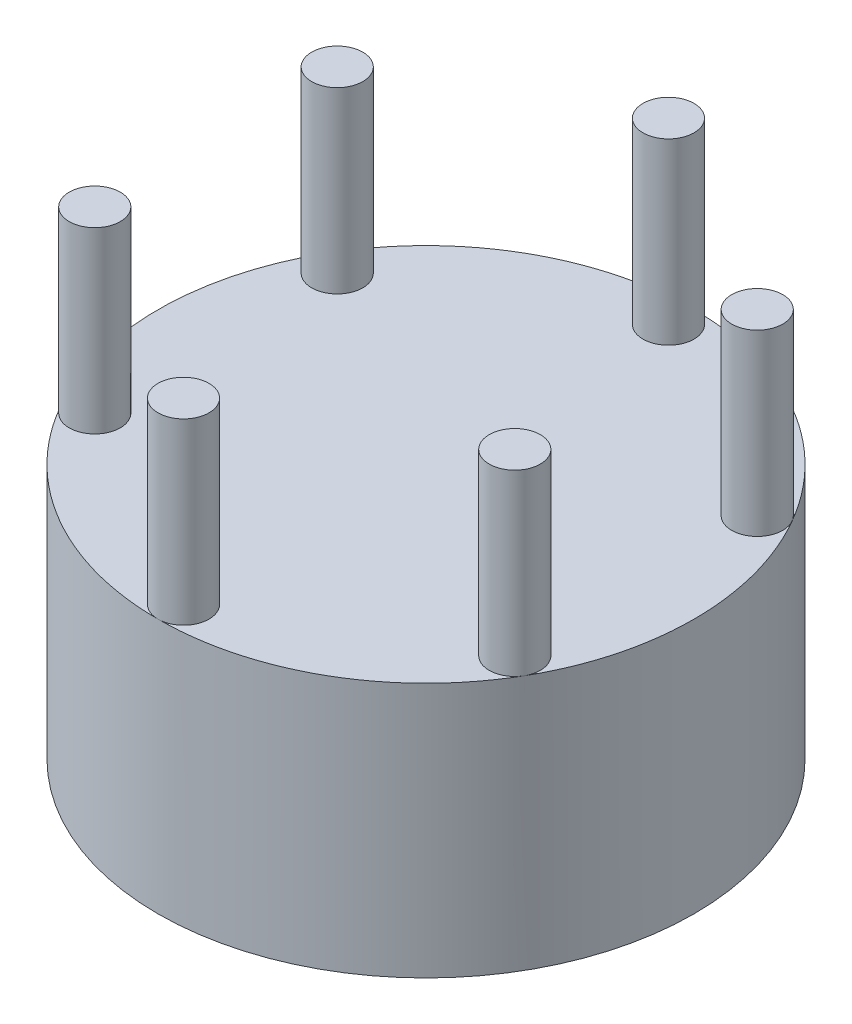
ISO-10303-21;
HEADER;
FILE_DESCRIPTION(('STEP AP214'),'2;1');
FILE_NAME('part.step','',(''),(''),'','','');
FILE_SCHEMA(('AUTOMOTIVE_DESIGN { 1 0 10303 214 1 1 1 1 }'));
ENDSEC;
DATA;
#1=APPLICATION_CONTEXT('core data for automotive mechanical design processes');
#2=APPLICATION_PROTOCOL_DEFINITION('international standard','automotive_design',2000,#1);
#3=PRODUCT_CONTEXT('',#1,'mechanical');
#4=PRODUCT('Part','Part','',(#3));
#5=PRODUCT_RELATED_PRODUCT_CATEGORY('part','',(#4));
#6=PRODUCT_DEFINITION_FORMATION('','',#4);
#7=PRODUCT_DEFINITION_CONTEXT('part definition',#1,'design');
#8=PRODUCT_DEFINITION('design','',#6,#7);
#9=PRODUCT_DEFINITION_SHAPE('','',#8);
#10=(LENGTH_UNIT() NAMED_UNIT(*) SI_UNIT(.MILLI.,.METRE.));
#11=(NAMED_UNIT(*) PLANE_ANGLE_UNIT() SI_UNIT($,.RADIAN.));
#12=(NAMED_UNIT(*) SI_UNIT($,.STERADIAN.) SOLID_ANGLE_UNIT());
#13=UNCERTAINTY_MEASURE_WITH_UNIT(LENGTH_MEASURE(1.E-05),#10,'distance_accuracy_value','');
#14=(GEOMETRIC_REPRESENTATION_CONTEXT(3) GLOBAL_UNCERTAINTY_ASSIGNED_CONTEXT((#13)) GLOBAL_UNIT_ASSIGNED_CONTEXT((#10,
#11,#12)) REPRESENTATION_CONTEXT('',''));
#15=CARTESIAN_POINT('',(0.,0.,0.));
#16=DIRECTION('',(0.,0.,1.));
#17=DIRECTION('',(1.,0.,0.));
#18=AXIS2_PLACEMENT_3D('',#15,#16,#17);
#19=CARTESIAN_POINT('',(0.,20.,0.));
#20=DIRECTION('',(0.,-1.,0.));
#21=DIRECTION('',(0.,0.,-1.));
#22=AXIS2_PLACEMENT_3D('',#19,#20,#21);
#23=CYLINDRICAL_SURFACE('',#22,21.);
#24=CARTESIAN_POINT('',(0.,20.,0.));
#25=DIRECTION('',(0.,1.,0.));
#26=DIRECTION('',(0.,0.,1.));
#27=AXIS2_PLACEMENT_3D('',#24,#25,#26);
#28=CIRCLE('',#27,21.);
#29=CARTESIAN_POINT('',(0.,20.,21.));
#30=VERTEX_POINT('',#29);
#31=CARTESIAN_POINT('',(18.1865334794731,20.,10.5000000000002));
#32=VERTEX_POINT('',#31);
#33=EDGE_CURVE('E11',#30,#32,#28,.T.);
#34=ORIENTED_EDGE('',*,*,#33,.F.);
#35=CARTESIAN_POINT('',(-18.1865334794732,20.,10.5));
#36=VERTEX_POINT('',#35);
#37=EDGE_CURVE('E49',#36,#30,#28,.T.);
#38=ORIENTED_EDGE('',*,*,#37,.F.);
#39=CARTESIAN_POINT('',(-18.1865334794732,20.,-10.5000000000001));
#40=VERTEX_POINT('',#39);
#41=EDGE_CURVE('E83',#40,#36,#28,.T.);
#42=ORIENTED_EDGE('',*,*,#41,.F.);
#43=CARTESIAN_POINT('',(0.,20.,-21.));
#44=VERTEX_POINT('',#43);
#45=EDGE_CURVE('E297',#44,#40,#28,.T.);
#46=ORIENTED_EDGE('',*,*,#45,.F.);
#47=CARTESIAN_POINT('',(18.1865334794733,20.,-10.4999999999998));
#48=VERTEX_POINT('',#47);
#49=EDGE_CURVE('E295',#48,#44,#28,.T.);
#50=ORIENTED_EDGE('',*,*,#49,.F.);
#51=EDGE_CURVE('E48',#32,#48,#28,.T.);
#52=ORIENTED_EDGE('',*,*,#51,.F.);
#53=EDGE_LOOP('',(#34,#38,#42,#46,#50,#52));
#54=FACE_BOUND('',#53,.T.);
#55=CARTESIAN_POINT('',(0.,0.,0.));
#56=DIRECTION('',(0.,1.,0.));
#57=DIRECTION('',(0.,0.,1.));
#58=AXIS2_PLACEMENT_3D('',#55,#56,#57);
#59=CIRCLE('',#58,21.);
#60=CARTESIAN_POINT('',(0.,0.,21.));
#61=VERTEX_POINT('',#60);
#62=EDGE_CURVE('E43',#61,#61,#59,.T.);
#63=ORIENTED_EDGE('',*,*,#62,.T.);
#64=EDGE_LOOP('',(#63));
#65=FACE_BOUND('',#64,.T.);
#66=ADVANCED_FACE('F40',(#54,#65),#23,.T.);
#67=CARTESIAN_POINT('',(0.,20.,0.));
#68=DIRECTION('',(0.,1.,0.));
#69=DIRECTION('',(0.,0.,1.));
#70=AXIS2_PLACEMENT_3D('',#67,#68,#69);
#71=PLANE('',#70);
#72=ORIENTED_EDGE('',*,*,#33,.T.);
#73=CARTESIAN_POINT('',(16.4544826719042,20.,9.50000000000019));
#74=DIRECTION('',(0.,1.,0.));
#75=DIRECTION('',(0.866025403784433,0.,0.50000000000001));
#76=AXIS2_PLACEMENT_3D('',#73,#74,#75);
#77=CIRCLE('',#76,2.);
#78=EDGE_CURVE('E54',#32,#32,#77,.T.);
#79=ORIENTED_EDGE('',*,*,#78,.F.);
#80=ORIENTED_EDGE('',*,*,#51,.T.);
#81=CARTESIAN_POINT('',(16.4544826719044,20.,-9.49999999999985));
#82=DIRECTION('',(0.,1.,0.));
#83=DIRECTION('',(0.866025403784443,0.,-0.499999999999992));
#84=AXIS2_PLACEMENT_3D('',#81,#82,#83);
#85=CIRCLE('',#84,2.);
#86=EDGE_CURVE('E89',#48,#48,#85,.T.);
#87=ORIENTED_EDGE('',*,*,#86,.F.);
#88=ORIENTED_EDGE('',*,*,#49,.T.);
#89=CARTESIAN_POINT('',(0.,20.,-19.));
#90=DIRECTION('',(0.,1.,0.));
#91=DIRECTION('',(0.,0.,-1.));
#92=AXIS2_PLACEMENT_3D('',#89,#90,#91);
#93=CIRCLE('',#92,2.);
#94=EDGE_CURVE('E95',#44,#44,#93,.T.);
#95=ORIENTED_EDGE('',*,*,#94,.F.);
#96=ORIENTED_EDGE('',*,*,#45,.T.);
#97=CARTESIAN_POINT('',(-16.4544826719043,20.,-9.50000000000008));
#98=DIRECTION('',(0.,1.,0.));
#99=DIRECTION('',(-0.866025403784436,0.,-0.500000000000004));
#100=AXIS2_PLACEMENT_3D('',#97,#98,#99);
#101=CIRCLE('',#100,2.);
#102=EDGE_CURVE('E100',#40,#40,#101,.T.);
#103=ORIENTED_EDGE('',*,*,#102,.F.);
#104=ORIENTED_EDGE('',*,*,#41,.T.);
#105=CARTESIAN_POINT('',(-16.4544826719044,20.,9.49999999999996));
#106=DIRECTION('',(0.,1.,0.));
#107=DIRECTION('',(-0.86602540378444,0.,0.499999999999998));
#108=AXIS2_PLACEMENT_3D('',#105,#106,#107);
#109=CIRCLE('',#108,2.);
#110=EDGE_CURVE('E80',#36,#36,#109,.T.);
#111=ORIENTED_EDGE('',*,*,#110,.F.);
#112=ORIENTED_EDGE('',*,*,#37,.T.);
#113=CARTESIAN_POINT('',(0.,20.,19.));
#114=DIRECTION('',(0.,1.,0.));
#115=DIRECTION('',(0.,0.,1.));
#116=AXIS2_PLACEMENT_3D('',#113,#114,#115);
#117=CIRCLE('',#116,2.);
#118=EDGE_CURVE('E78',#30,#30,#117,.T.);
#119=ORIENTED_EDGE('',*,*,#118,.F.);
#120=EDGE_LOOP('',(#72,#79,#80,#87,#88,#95,#96,#103,#104,#111,#112,#119));
#121=FACE_BOUND('',#120,.T.);
#122=ADVANCED_FACE('F76',(#121),#71,.T.);
#123=CARTESIAN_POINT('',(0.,0.,0.));
#124=DIRECTION('',(0.,1.,0.));
#125=DIRECTION('',(0.,0.,1.));
#126=AXIS2_PLACEMENT_3D('',#123,#124,#125);
#127=PLANE('',#126);
#128=ORIENTED_EDGE('',*,*,#62,.F.);
#129=EDGE_LOOP('',(#128));
#130=FACE_BOUND('',#129,.T.);
#131=ADVANCED_FACE('F119',(#130),#127,.F.);
#132=CARTESIAN_POINT('',(0.,34.,19.));
#133=DIRECTION('',(0.,-1.,0.));
#134=DIRECTION('',(0.,0.,-1.));
#135=AXIS2_PLACEMENT_3D('',#132,#133,#134);
#136=CYLINDRICAL_SURFACE('',#135,2.);
#137=CARTESIAN_POINT('',(0.,34.,19.));
#138=DIRECTION('',(0.,1.,0.));
#139=DIRECTION('',(0.,0.,1.));
#140=AXIS2_PLACEMENT_3D('',#137,#138,#139);
#141=CIRCLE('',#140,2.);
#142=CARTESIAN_POINT('',(0.,34.,21.));
#143=VERTEX_POINT('',#142);
#144=EDGE_CURVE('E112',#143,#143,#141,.T.);
#145=ORIENTED_EDGE('',*,*,#144,.F.);
#146=EDGE_LOOP('',(#145));
#147=FACE_BOUND('',#146,.T.);
#148=ORIENTED_EDGE('',*,*,#118,.T.);
#149=EDGE_LOOP('',(#148));
#150=FACE_BOUND('',#149,.T.);
#151=ADVANCED_FACE('F116',(#147,#150),#136,.T.);
#152=CARTESIAN_POINT('',(0.,34.,19.));
#153=DIRECTION('',(0.,1.,0.));
#154=DIRECTION('',(0.,0.,1.));
#155=AXIS2_PLACEMENT_3D('',#152,#153,#154);
#156=PLANE('',#155);
#157=ORIENTED_EDGE('',*,*,#144,.T.);
#158=EDGE_LOOP('',(#157));
#159=FACE_BOUND('',#158,.T.);
#160=ADVANCED_FACE('F118',(#159),#156,.T.);
#161=CARTESIAN_POINT('',(-16.4544826719044,34.,9.49999999999996));
#162=DIRECTION('',(0.,-1.,0.));
#163=DIRECTION('',(0.,0.,-1.));
#164=AXIS2_PLACEMENT_3D('',#161,#162,#163);
#165=CYLINDRICAL_SURFACE('',#164,2.);
#166=CARTESIAN_POINT('',(-16.4544826719044,34.,9.49999999999996));
#167=DIRECTION('',(0.,1.,0.));
#168=DIRECTION('',(-0.86602540378444,0.,0.499999999999998));
#169=AXIS2_PLACEMENT_3D('',#166,#167,#168);
#170=CIRCLE('',#169,2.);
#171=CARTESIAN_POINT('',(-18.1865334794732,34.,10.5));
#172=VERTEX_POINT('',#171);
#173=EDGE_CURVE('E108',#172,#172,#170,.T.);
#174=ORIENTED_EDGE('',*,*,#173,.F.);
#175=EDGE_LOOP('',(#174));
#176=FACE_BOUND('',#175,.T.);
#177=ORIENTED_EDGE('',*,*,#110,.T.);
#178=EDGE_LOOP('',(#177));
#179=FACE_BOUND('',#178,.T.);
#180=ADVANCED_FACE('F126',(#176,#179),#165,.T.);
#181=CARTESIAN_POINT('',(-16.4544826719044,34.,9.49999999999996));
#182=DIRECTION('',(0.,1.,0.));
#183=DIRECTION('',(-0.86602540378444,0.,0.499999999999998));
#184=AXIS2_PLACEMENT_3D('',#181,#182,#183);
#185=PLANE('',#184);
#186=ORIENTED_EDGE('',*,*,#173,.T.);
#187=EDGE_LOOP('',(#186));
#188=FACE_BOUND('',#187,.T.);
#189=ADVANCED_FACE('F162',(#188),#185,.T.);
#190=CARTESIAN_POINT('',(-16.4544826719043,34.,-9.50000000000008));
#191=DIRECTION('',(0.,-1.,0.));
#192=DIRECTION('',(0.,0.,-1.));
#193=AXIS2_PLACEMENT_3D('',#190,#191,#192);
#194=CYLINDRICAL_SURFACE('',#193,2.);
#195=CARTESIAN_POINT('',(-16.4544826719043,34.,-9.50000000000008));
#196=DIRECTION('',(0.,1.,0.));
#197=DIRECTION('',(-0.866025403784436,0.,-0.500000000000004));
#198=AXIS2_PLACEMENT_3D('',#195,#196,#197);
#199=CIRCLE('',#198,2.);
#200=CARTESIAN_POINT('',(-18.1865334794732,34.,-10.5000000000001));
#201=VERTEX_POINT('',#200);
#202=EDGE_CURVE('E103',#201,#201,#199,.T.);
#203=ORIENTED_EDGE('',*,*,#202,.F.);
#204=EDGE_LOOP('',(#203));
#205=FACE_BOUND('',#204,.T.);
#206=ORIENTED_EDGE('',*,*,#102,.T.);
#207=EDGE_LOOP('',(#206));
#208=FACE_BOUND('',#207,.T.);
#209=ADVANCED_FACE('F172',(#205,#208),#194,.T.);
#210=CARTESIAN_POINT('',(-16.4544826719043,34.,-9.50000000000008));
#211=DIRECTION('',(0.,1.,0.));
#212=DIRECTION('',(-0.866025403784436,0.,-0.500000000000004));
#213=AXIS2_PLACEMENT_3D('',#210,#211,#212);
#214=PLANE('',#213);
#215=ORIENTED_EDGE('',*,*,#202,.T.);
#216=EDGE_LOOP('',(#215));
#217=FACE_BOUND('',#216,.T.);
#218=ADVANCED_FACE('F182',(#217),#214,.T.);
#219=CARTESIAN_POINT('',(0.,34.,-19.));
#220=DIRECTION('',(0.,-1.,0.));
#221=DIRECTION('',(0.,0.,-1.));
#222=AXIS2_PLACEMENT_3D('',#219,#220,#221);
#223=CYLINDRICAL_SURFACE('',#222,2.);
#224=CARTESIAN_POINT('',(0.,34.,-19.));
#225=DIRECTION('',(0.,1.,0.));
#226=DIRECTION('',(0.,0.,-1.));
#227=AXIS2_PLACEMENT_3D('',#224,#225,#226);
#228=CIRCLE('',#227,2.);
#229=CARTESIAN_POINT('',(0.,34.,-21.));
#230=VERTEX_POINT('',#229);
#231=EDGE_CURVE('E97',#230,#230,#228,.T.);
#232=ORIENTED_EDGE('',*,*,#231,.F.);
#233=EDGE_LOOP('',(#232));
#234=FACE_BOUND('',#233,.T.);
#235=ORIENTED_EDGE('',*,*,#94,.T.);
#236=EDGE_LOOP('',(#235));
#237=FACE_BOUND('',#236,.T.);
#238=ADVANCED_FACE('F192',(#234,#237),#223,.T.);
#239=CARTESIAN_POINT('',(0.,34.,-19.));
#240=DIRECTION('',(0.,1.,0.));
#241=DIRECTION('',(0.,0.,-1.));
#242=AXIS2_PLACEMENT_3D('',#239,#240,#241);
#243=PLANE('',#242);
#244=ORIENTED_EDGE('',*,*,#231,.T.);
#245=EDGE_LOOP('',(#244));
#246=FACE_BOUND('',#245,.T.);
#247=ADVANCED_FACE('F202',(#246),#243,.T.);
#248=CARTESIAN_POINT('',(16.4544826719044,34.,-9.49999999999985));
#249=DIRECTION('',(0.,-1.,0.));
#250=DIRECTION('',(0.,0.,-1.));
#251=AXIS2_PLACEMENT_3D('',#248,#249,#250);
#252=CYLINDRICAL_SURFACE('',#251,2.);
#253=CARTESIAN_POINT('',(16.4544826719044,34.,-9.49999999999985));
#254=DIRECTION('',(0.,1.,0.));
#255=DIRECTION('',(0.866025403784443,0.,-0.499999999999992));
#256=AXIS2_PLACEMENT_3D('',#253,#254,#255);
#257=CIRCLE('',#256,2.);
#258=CARTESIAN_POINT('',(18.1865334794733,34.,-10.4999999999998));
#259=VERTEX_POINT('',#258);
#260=EDGE_CURVE('E92',#259,#259,#257,.T.);
#261=ORIENTED_EDGE('',*,*,#260,.F.);
#262=EDGE_LOOP('',(#261));
#263=FACE_BOUND('',#262,.T.);
#264=ORIENTED_EDGE('',*,*,#86,.T.);
#265=EDGE_LOOP('',(#264));
#266=FACE_BOUND('',#265,.T.);
#267=ADVANCED_FACE('F212',(#263,#266),#252,.T.);
#268=CARTESIAN_POINT('',(16.4544826719044,34.,-9.49999999999985));
#269=DIRECTION('',(0.,1.,0.));
#270=DIRECTION('',(0.866025403784443,0.,-0.499999999999992));
#271=AXIS2_PLACEMENT_3D('',#268,#269,#270);
#272=PLANE('',#271);
#273=ORIENTED_EDGE('',*,*,#260,.T.);
#274=EDGE_LOOP('',(#273));
#275=FACE_BOUND('',#274,.T.);
#276=ADVANCED_FACE('F222',(#275),#272,.T.);
#277=CARTESIAN_POINT('',(16.4544826719042,34.,9.50000000000019));
#278=DIRECTION('',(0.,-1.,0.));
#279=DIRECTION('',(0.,0.,-1.));
#280=AXIS2_PLACEMENT_3D('',#277,#278,#279);
#281=CYLINDRICAL_SURFACE('',#280,2.);
#282=CARTESIAN_POINT('',(16.4544826719042,34.,9.50000000000019));
#283=DIRECTION('',(0.,1.,0.));
#284=DIRECTION('',(0.866025403784433,0.,0.50000000000001));
#285=AXIS2_PLACEMENT_3D('',#282,#283,#284);
#286=CIRCLE('',#285,2.);
#287=CARTESIAN_POINT('',(18.1865334794731,34.,10.5000000000002));
#288=VERTEX_POINT('',#287);
#289=EDGE_CURVE('E86',#288,#288,#286,.T.);
#290=ORIENTED_EDGE('',*,*,#289,.F.);
#291=EDGE_LOOP('',(#290));
#292=FACE_BOUND('',#291,.T.);
#293=ORIENTED_EDGE('',*,*,#78,.T.);
#294=EDGE_LOOP('',(#293));
#295=FACE_BOUND('',#294,.T.);
#296=ADVANCED_FACE('F232',(#292,#295),#281,.T.);
#297=CARTESIAN_POINT('',(16.4544826719042,34.,9.50000000000019));
#298=DIRECTION('',(0.,1.,0.));
#299=DIRECTION('',(0.866025403784433,0.,0.50000000000001));
#300=AXIS2_PLACEMENT_3D('',#297,#298,#299);
#301=PLANE('',#300);
#302=ORIENTED_EDGE('',*,*,#289,.T.);
#303=EDGE_LOOP('',(#302));
#304=FACE_BOUND('',#303,.T.);
#305=ADVANCED_FACE('F242',(#304),#301,.T.);
#306=CLOSED_SHELL('',(#66,#122,#131,#151,#160,#180,#189,#209,#218,#238,#247,#267,#276,#296,#305));
#307=MANIFOLD_SOLID_BREP('B2',#306);
#308=ADVANCED_BREP_SHAPE_REPRESENTATION('',(#18,#307),#14);
#309=SHAPE_DEFINITION_REPRESENTATION(#9,#308);
ENDSEC;
END-ISO-10303-21;
